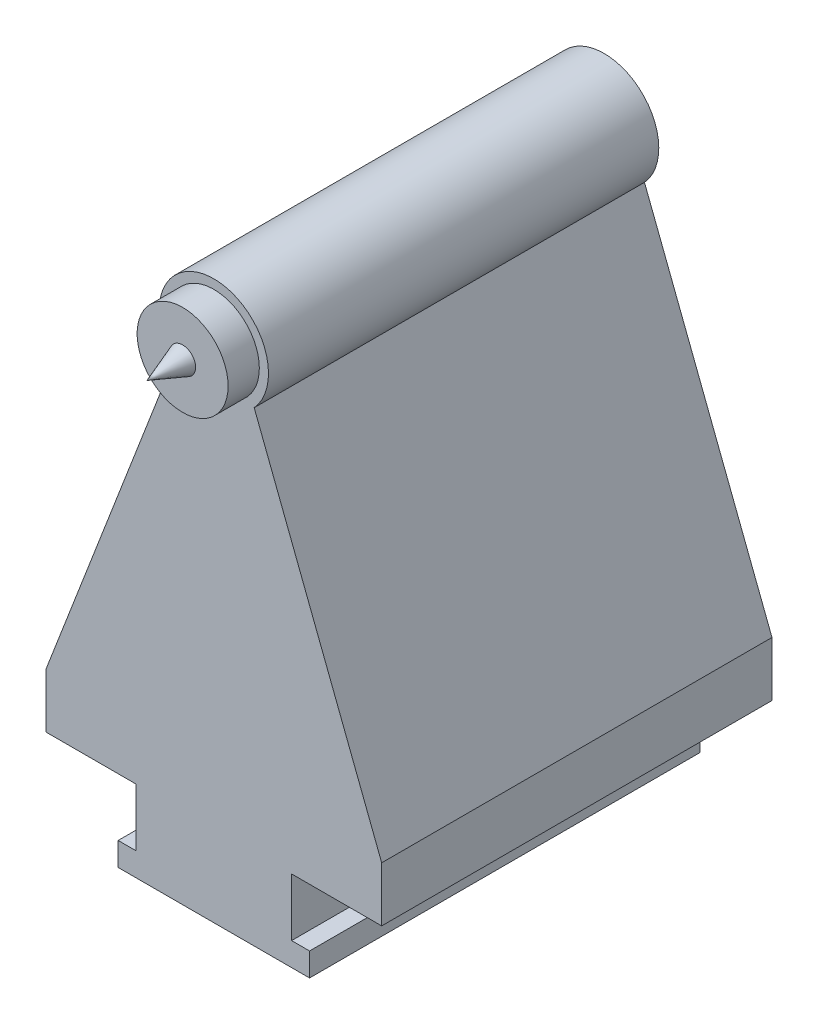
ISO-10303-21;
HEADER;
FILE_DESCRIPTION(('STEP AP214'),'2;1');
FILE_NAME('part.step','',(''),(''),'','','');
FILE_SCHEMA(('AUTOMOTIVE_DESIGN { 1 0 10303 214 1 1 1 1 }'));
ENDSEC;
DATA;
#1=APPLICATION_CONTEXT('core data for automotive mechanical design processes');
#2=APPLICATION_PROTOCOL_DEFINITION('international standard','automotive_design',2000,#1);
#3=PRODUCT_CONTEXT('',#1,'mechanical');
#4=PRODUCT('Part','Part','',(#3));
#5=PRODUCT_RELATED_PRODUCT_CATEGORY('part','',(#4));
#6=PRODUCT_DEFINITION_FORMATION('','',#4);
#7=PRODUCT_DEFINITION_CONTEXT('part definition',#1,'design');
#8=PRODUCT_DEFINITION('design','',#6,#7);
#9=PRODUCT_DEFINITION_SHAPE('','',#8);
#10=(LENGTH_UNIT() NAMED_UNIT(*) SI_UNIT(.MILLI.,.METRE.));
#11=(NAMED_UNIT(*) PLANE_ANGLE_UNIT() SI_UNIT($,.RADIAN.));
#12=(NAMED_UNIT(*) SI_UNIT($,.STERADIAN.) SOLID_ANGLE_UNIT());
#13=UNCERTAINTY_MEASURE_WITH_UNIT(LENGTH_MEASURE(1.E-05),#10,'distance_accuracy_value','');
#14=(GEOMETRIC_REPRESENTATION_CONTEXT(3) GLOBAL_UNCERTAINTY_ASSIGNED_CONTEXT((#13)) GLOBAL_UNIT_ASSIGNED_CONTEXT((#10,
#11,#12)) REPRESENTATION_CONTEXT('',''));
#15=CARTESIAN_POINT('',(0.,0.,0.));
#16=DIRECTION('',(0.,0.,1.));
#17=DIRECTION('',(1.,0.,0.));
#18=AXIS2_PLACEMENT_3D('',#15,#16,#17);
#19=CARTESIAN_POINT('',(258.134543793799,99.6200797159665,250.));
#20=DIRECTION('',(-0.932936237589077,-0.360041631749909,0.));
#21=DIRECTION('',(0.360041631749909,-0.932936237589077,0.));
#22=AXIS2_PLACEMENT_3D('',#19,#20,#21);
#23=PLANE('',#22);
#24=DIRECTION('',(-0.360041631749909,0.932936237589077,0.));
#25=VECTOR('',#24,1.);
#26=CARTESIAN_POINT('',(258.134543793799,99.6200797159665,0.));
#27=LINE('',#26,#25);
#28=CARTESIAN_POINT('',(227.500000000004,179.000000000001,0.));
#29=VERTEX_POINT('',#28);
#30=CARTESIAN_POINT('',(145.832850365107,390.615092801068,0.));
#31=VERTEX_POINT('',#30);
#32=EDGE_CURVE('E166',#29,#31,#27,.T.);
#33=ORIENTED_EDGE('',*,*,#32,.T.);
#34=DIRECTION('',(0.,0.,-1.));
#35=VECTOR('',#34,1.);
#36=CARTESIAN_POINT('',(145.832850365107,390.615092801068,250.));
#37=LINE('',#36,#35);
#38=CARTESIAN_POINT('',(145.832850365107,390.615092801068,250.));
#39=VERTEX_POINT('',#38);
#40=EDGE_CURVE('E11',#39,#31,#37,.T.);
#41=ORIENTED_EDGE('',*,*,#40,.F.);
#42=DIRECTION('',(-0.360041631749909,0.932936237589077,0.));
#43=VECTOR('',#42,1.);
#44=CARTESIAN_POINT('',(258.134543793799,99.6200797159665,250.));
#45=LINE('',#44,#43);
#46=CARTESIAN_POINT('',(227.500000000004,179.000000000001,250.));
#47=VERTEX_POINT('',#46);
#48=EDGE_CURVE('E195',#47,#39,#45,.T.);
#49=ORIENTED_EDGE('',*,*,#48,.F.);
#50=DIRECTION('',(0.,0.,-1.));
#51=VECTOR('',#50,1.);
#52=CARTESIAN_POINT('',(227.500000000004,179.000000000001,250.));
#53=LINE('',#52,#51);
#54=EDGE_CURVE('E162',#47,#29,#53,.T.);
#55=ORIENTED_EDGE('',*,*,#54,.T.);
#56=EDGE_LOOP('',(#33,#41,#49,#55));
#57=FACE_BOUND('',#56,.T.);
#58=ADVANCED_FACE('F32',(#57),#23,.F.);
#59=CARTESIAN_POINT('',(120.000000000003,414.230000000002,250.));
#60=DIRECTION('',(0.,0.,-1.));
#61=DIRECTION('',(-1.,0.,0.));
#62=AXIS2_PLACEMENT_3D('',#59,#60,#61);
#63=CYLINDRICAL_SURFACE('',#62,35.);
#64=CARTESIAN_POINT('',(120.000000000003,414.230000000002,0.));
#65=DIRECTION('',(0.,0.,1.));
#66=DIRECTION('',(1.,0.,0.));
#67=AXIS2_PLACEMENT_3D('',#64,#65,#66);
#68=CIRCLE('',#67,35.);
#69=CARTESIAN_POINT('',(94.1671496349019,390.615092801067,0.));
#70=VERTEX_POINT('',#69);
#71=EDGE_CURVE('E169',#31,#70,#68,.T.);
#72=ORIENTED_EDGE('',*,*,#71,.T.);
#73=DIRECTION('',(0.,0.,-1.));
#74=VECTOR('',#73,1.);
#75=CARTESIAN_POINT('',(94.1671496349019,390.615092801067,250.));
#76=LINE('',#75,#74);
#77=CARTESIAN_POINT('',(94.1671496349019,390.615092801067,250.));
#78=VERTEX_POINT('',#77);
#79=EDGE_CURVE('E40',#78,#70,#76,.T.);
#80=ORIENTED_EDGE('',*,*,#79,.F.);
#81=CARTESIAN_POINT('',(120.000000000003,414.230000000002,250.));
#82=DIRECTION('',(0.,0.,1.));
#83=DIRECTION('',(1.,0.,0.));
#84=AXIS2_PLACEMENT_3D('',#81,#82,#83);
#85=CIRCLE('',#84,35.);
#86=EDGE_CURVE('E110',#39,#78,#85,.T.);
#87=ORIENTED_EDGE('',*,*,#86,.F.);
#88=ORIENTED_EDGE('',*,*,#40,.T.);
#89=EDGE_LOOP('',(#72,#80,#87,#88));
#90=FACE_BOUND('',#89,.T.);
#91=ADVANCED_FACE('F279',(#90),#63,.T.);
#92=CARTESIAN_POINT('',(-49.2457381761471,19.0050672439191,250.));
#93=DIRECTION('',(0.932936237589074,-0.360041631749917,0.));
#94=DIRECTION('',(0.360041631749917,0.932936237589074,0.));
#95=AXIS2_PLACEMENT_3D('',#92,#93,#94);
#96=PLANE('',#95);
#97=DIRECTION('',(-0.360041631749917,-0.932936237589074,0.));
#98=VECTOR('',#97,1.);
#99=CARTESIAN_POINT('',(-49.2457381761471,19.0050672439191,0.));
#100=LINE('',#99,#98);
#101=CARTESIAN_POINT('',(12.5000000000037,179.000000000001,0.));
#102=VERTEX_POINT('',#101);
#103=EDGE_CURVE('E172',#70,#102,#100,.T.);
#104=ORIENTED_EDGE('',*,*,#103,.T.);
#105=DIRECTION('',(0.,0.,-1.));
#106=VECTOR('',#105,1.);
#107=CARTESIAN_POINT('',(12.5000000000037,179.000000000001,250.));
#108=LINE('',#107,#106);
#109=CARTESIAN_POINT('',(12.5000000000037,179.000000000001,250.));
#110=VERTEX_POINT('',#109);
#111=EDGE_CURVE('E219',#110,#102,#108,.T.);
#112=ORIENTED_EDGE('',*,*,#111,.F.);
#113=DIRECTION('',(-0.360041631749917,-0.932936237589074,0.));
#114=VECTOR('',#113,1.);
#115=CARTESIAN_POINT('',(-49.2457381761471,19.0050672439191,250.));
#116=LINE('',#115,#114);
#117=EDGE_CURVE('E226',#78,#110,#116,.T.);
#118=ORIENTED_EDGE('',*,*,#117,.F.);
#119=ORIENTED_EDGE('',*,*,#79,.T.);
#120=EDGE_LOOP('',(#104,#112,#118,#119));
#121=FACE_BOUND('',#120,.T.);
#122=ADVANCED_FACE('F224',(#121),#96,.F.);
#123=CARTESIAN_POINT('',(12.5000000000035,0.,250.));
#124=DIRECTION('',(-1.,0.,0.));
#125=DIRECTION('',(0.,-1.,0.));
#126=AXIS2_PLACEMENT_3D('',#123,#124,#125);
#127=PLANE('',#126);
#128=DIRECTION('',(0.,1.,0.));
#129=VECTOR('',#128,1.);
#130=CARTESIAN_POINT('',(12.5000000000035,0.,0.));
#131=LINE('',#130,#129);
#132=CARTESIAN_POINT('',(12.5000000000037,144.000000000001,0.));
#133=VERTEX_POINT('',#132);
#134=EDGE_CURVE('E175',#133,#102,#131,.T.);
#135=ORIENTED_EDGE('',*,*,#134,.F.);
#136=DIRECTION('',(0.,0.,-1.));
#137=VECTOR('',#136,1.);
#138=CARTESIAN_POINT('',(12.5000000000037,144.000000000001,250.));
#139=LINE('',#138,#137);
#140=CARTESIAN_POINT('',(12.5000000000037,144.000000000001,250.));
#141=VERTEX_POINT('',#140);
#142=EDGE_CURVE('E217',#141,#133,#139,.T.);
#143=ORIENTED_EDGE('',*,*,#142,.F.);
#144=DIRECTION('',(0.,1.,0.));
#145=VECTOR('',#144,1.);
#146=CARTESIAN_POINT('',(12.5000000000035,0.,250.));
#147=LINE('',#146,#145);
#148=EDGE_CURVE('E238',#141,#110,#147,.T.);
#149=ORIENTED_EDGE('',*,*,#148,.T.);
#150=ORIENTED_EDGE('',*,*,#111,.T.);
#151=EDGE_LOOP('',(#135,#143,#149,#150));
#152=FACE_BOUND('',#151,.T.);
#153=ADVANCED_FACE('F234',(#152),#127,.T.);
#154=CARTESIAN_POINT('',(0.,144.000000000001,250.));
#155=DIRECTION('',(0.,1.,0.));
#156=DIRECTION('',(0.,0.,1.));
#157=AXIS2_PLACEMENT_3D('',#154,#155,#156);
#158=PLANE('',#157);
#159=DIRECTION('',(1.,0.,0.));
#160=VECTOR('',#159,1.);
#161=CARTESIAN_POINT('',(0.,144.000000000001,0.));
#162=LINE('',#161,#160);
#163=CARTESIAN_POINT('',(70.2000000000066,144.000000000001,0.));
#164=VERTEX_POINT('',#163);
#165=EDGE_CURVE('E178',#133,#164,#162,.T.);
#166=ORIENTED_EDGE('',*,*,#165,.T.);
#167=DIRECTION('',(0.,0.,-1.));
#168=VECTOR('',#167,1.);
#169=CARTESIAN_POINT('',(70.2000000000066,144.000000000001,250.));
#170=LINE('',#169,#168);
#171=CARTESIAN_POINT('',(70.2000000000066,144.000000000001,250.));
#172=VERTEX_POINT('',#171);
#173=EDGE_CURVE('E214',#172,#164,#170,.T.);
#174=ORIENTED_EDGE('',*,*,#173,.F.);
#175=DIRECTION('',(1.,0.,0.));
#176=VECTOR('',#175,1.);
#177=CARTESIAN_POINT('',(0.,144.000000000001,250.));
#178=LINE('',#177,#176);
#179=EDGE_CURVE('E239',#141,#172,#178,.T.);
#180=ORIENTED_EDGE('',*,*,#179,.F.);
#181=ORIENTED_EDGE('',*,*,#142,.T.);
#182=EDGE_LOOP('',(#166,#174,#180,#181));
#183=FACE_BOUND('',#182,.T.);
#184=ADVANCED_FACE('F290',(#183),#158,.F.);
#185=CARTESIAN_POINT('',(70.2000000000067,0.,250.));
#186=DIRECTION('',(1.,0.,0.));
#187=DIRECTION('',(0.,1.,0.));
#188=AXIS2_PLACEMENT_3D('',#185,#186,#187);
#189=PLANE('',#188);
#190=DIRECTION('',(0.,-1.,0.));
#191=VECTOR('',#190,1.);
#192=CARTESIAN_POINT('',(70.2000000000067,0.,0.));
#193=LINE('',#192,#191);
#194=CARTESIAN_POINT('',(70.2000000000066,107.000000000001,0.));
#195=VERTEX_POINT('',#194);
#196=EDGE_CURVE('E180',#164,#195,#193,.T.);
#197=ORIENTED_EDGE('',*,*,#196,.T.);
#198=DIRECTION('',(0.,0.,-1.));
#199=VECTOR('',#198,1.);
#200=CARTESIAN_POINT('',(70.2000000000066,107.000000000001,250.));
#201=LINE('',#200,#199);
#202=CARTESIAN_POINT('',(70.2000000000066,107.000000000001,250.));
#203=VERTEX_POINT('',#202);
#204=EDGE_CURVE('E211',#203,#195,#201,.T.);
#205=ORIENTED_EDGE('',*,*,#204,.F.);
#206=DIRECTION('',(0.,-1.,0.));
#207=VECTOR('',#206,1.);
#208=CARTESIAN_POINT('',(70.2000000000067,0.,250.));
#209=LINE('',#208,#207);
#210=EDGE_CURVE('E241',#172,#203,#209,.T.);
#211=ORIENTED_EDGE('',*,*,#210,.F.);
#212=ORIENTED_EDGE('',*,*,#173,.T.);
#213=EDGE_LOOP('',(#197,#205,#211,#212));
#214=FACE_BOUND('',#213,.T.);
#215=ADVANCED_FACE('F293',(#214),#189,.F.);
#216=CARTESIAN_POINT('',(0.,107.000000000001,250.));
#217=DIRECTION('',(0.,-1.,0.));
#218=DIRECTION('',(0.,0.,-1.));
#219=AXIS2_PLACEMENT_3D('',#216,#217,#218);
#220=PLANE('',#219);
#221=DIRECTION('',(-1.,0.,0.));
#222=VECTOR('',#221,1.);
#223=CARTESIAN_POINT('',(0.,107.000000000001,0.));
#224=LINE('',#223,#222);
#225=CARTESIAN_POINT('',(58.7000000000066,107.000000000001,0.));
#226=VERTEX_POINT('',#225);
#227=EDGE_CURVE('E182',#195,#226,#224,.T.);
#228=ORIENTED_EDGE('',*,*,#227,.T.);
#229=DIRECTION('',(0.,0.,-1.));
#230=VECTOR('',#229,1.);
#231=CARTESIAN_POINT('',(58.7000000000066,107.000000000001,250.));
#232=LINE('',#231,#230);
#233=CARTESIAN_POINT('',(58.7000000000066,107.000000000001,250.));
#234=VERTEX_POINT('',#233);
#235=EDGE_CURVE('E208',#234,#226,#232,.T.);
#236=ORIENTED_EDGE('',*,*,#235,.F.);
#237=DIRECTION('',(-1.,0.,0.));
#238=VECTOR('',#237,1.);
#239=CARTESIAN_POINT('',(0.,107.000000000001,250.));
#240=LINE('',#239,#238);
#241=EDGE_CURVE('E247',#203,#234,#240,.T.);
#242=ORIENTED_EDGE('',*,*,#241,.F.);
#243=ORIENTED_EDGE('',*,*,#204,.T.);
#244=EDGE_LOOP('',(#228,#236,#242,#243));
#245=FACE_BOUND('',#244,.T.);
#246=ADVANCED_FACE('F297',(#245),#220,.F.);
#247=CARTESIAN_POINT('',(58.7000000000067,0.,250.));
#248=DIRECTION('',(1.,0.,0.));
#249=DIRECTION('',(0.,1.,0.));
#250=AXIS2_PLACEMENT_3D('',#247,#248,#249);
#251=PLANE('',#250);
#252=DIRECTION('',(0.,-1.,0.));
#253=VECTOR('',#252,1.);
#254=CARTESIAN_POINT('',(58.7000000000067,0.,0.));
#255=LINE('',#254,#253);
#256=CARTESIAN_POINT('',(58.7000000000066,91.9999999999995,0.));
#257=VERTEX_POINT('',#256);
#258=EDGE_CURVE('E184',#226,#257,#255,.T.);
#259=ORIENTED_EDGE('',*,*,#258,.T.);
#260=DIRECTION('',(0.,0.,-1.));
#261=VECTOR('',#260,1.);
#262=CARTESIAN_POINT('',(58.7000000000066,91.9999999999995,250.));
#263=LINE('',#262,#261);
#264=CARTESIAN_POINT('',(58.7000000000066,91.9999999999995,250.));
#265=VERTEX_POINT('',#264);
#266=EDGE_CURVE('E205',#265,#257,#263,.T.);
#267=ORIENTED_EDGE('',*,*,#266,.F.);
#268=DIRECTION('',(0.,-1.,0.));
#269=VECTOR('',#268,1.);
#270=CARTESIAN_POINT('',(58.7000000000067,0.,250.));
#271=LINE('',#270,#269);
#272=EDGE_CURVE('E249',#234,#265,#271,.T.);
#273=ORIENTED_EDGE('',*,*,#272,.F.);
#274=ORIENTED_EDGE('',*,*,#235,.T.);
#275=EDGE_LOOP('',(#259,#267,#273,#274));
#276=FACE_BOUND('',#275,.T.);
#277=ADVANCED_FACE('F301',(#276),#251,.F.);
#278=CARTESIAN_POINT('',(0.,91.9999999999995,250.));
#279=DIRECTION('',(0.,1.,0.));
#280=DIRECTION('',(-1.,0.,0.));
#281=AXIS2_PLACEMENT_3D('',#278,#279,#280);
#282=PLANE('',#281);
#283=DIRECTION('',(1.,0.,0.));
#284=VECTOR('',#283,1.);
#285=CARTESIAN_POINT('',(0.,91.9999999999995,0.));
#286=LINE('',#285,#284);
#287=CARTESIAN_POINT('',(181.3,91.9999999999995,0.));
#288=VERTEX_POINT('',#287);
#289=EDGE_CURVE('E186',#257,#288,#286,.T.);
#290=ORIENTED_EDGE('',*,*,#289,.T.);
#291=DIRECTION('',(0.,0.,-1.));
#292=VECTOR('',#291,1.);
#293=CARTESIAN_POINT('',(181.3,91.9999999999995,250.));
#294=LINE('',#293,#292);
#295=CARTESIAN_POINT('',(181.3,91.9999999999995,250.));
#296=VERTEX_POINT('',#295);
#297=EDGE_CURVE('E202',#296,#288,#294,.T.);
#298=ORIENTED_EDGE('',*,*,#297,.F.);
#299=DIRECTION('',(1.,0.,0.));
#300=VECTOR('',#299,1.);
#301=CARTESIAN_POINT('',(0.,91.9999999999995,250.));
#302=LINE('',#301,#300);
#303=EDGE_CURVE('E251',#265,#296,#302,.T.);
#304=ORIENTED_EDGE('',*,*,#303,.F.);
#305=ORIENTED_EDGE('',*,*,#266,.T.);
#306=EDGE_LOOP('',(#290,#298,#304,#305));
#307=FACE_BOUND('',#306,.T.);
#308=ADVANCED_FACE('F305',(#307),#282,.F.);
#309=CARTESIAN_POINT('',(181.3,-6.70944781215114E-13,250.));
#310=DIRECTION('',(-1.,0.,0.));
#311=DIRECTION('',(0.,-1.,0.));
#312=AXIS2_PLACEMENT_3D('',#309,#310,#311);
#313=PLANE('',#312);
#314=DIRECTION('',(0.,1.,0.));
#315=VECTOR('',#314,1.);
#316=CARTESIAN_POINT('',(181.3,-6.70944781215114E-13,0.));
#317=LINE('',#316,#315);
#318=CARTESIAN_POINT('',(181.3,107.,0.));
#319=VERTEX_POINT('',#318);
#320=EDGE_CURVE('E188',#288,#319,#317,.T.);
#321=ORIENTED_EDGE('',*,*,#320,.T.);
#322=DIRECTION('',(0.,0.,-1.));
#323=VECTOR('',#322,1.);
#324=CARTESIAN_POINT('',(181.3,107.,250.));
#325=LINE('',#324,#323);
#326=CARTESIAN_POINT('',(181.3,107.,250.));
#327=VERTEX_POINT('',#326);
#328=EDGE_CURVE('E199',#327,#319,#325,.T.);
#329=ORIENTED_EDGE('',*,*,#328,.F.);
#330=DIRECTION('',(0.,1.,0.));
#331=VECTOR('',#330,1.);
#332=CARTESIAN_POINT('',(181.3,-6.70944781215114E-13,250.));
#333=LINE('',#332,#331);
#334=EDGE_CURVE('E253',#296,#327,#333,.T.);
#335=ORIENTED_EDGE('',*,*,#334,.F.);
#336=ORIENTED_EDGE('',*,*,#297,.T.);
#337=EDGE_LOOP('',(#321,#329,#335,#336));
#338=FACE_BOUND('',#337,.T.);
#339=ADVANCED_FACE('F259',(#338),#313,.F.);
#340=CARTESIAN_POINT('',(7.10180706513065E-12,107.000000000012,250.));
#341=DIRECTION('',(0.,-1.,0.));
#342=DIRECTION('',(1.,0.,0.));
#343=AXIS2_PLACEMENT_3D('',#340,#341,#342);
#344=PLANE('',#343);
#345=DIRECTION('',(-1.,0.,0.));
#346=VECTOR('',#345,1.);
#347=CARTESIAN_POINT('',(7.10180706513065E-12,107.000000000012,0.));
#348=LINE('',#347,#346);
#349=CARTESIAN_POINT('',(169.800000000001,107.000000000001,0.));
#350=VERTEX_POINT('',#349);
#351=EDGE_CURVE('E190',#319,#350,#348,.T.);
#352=ORIENTED_EDGE('',*,*,#351,.T.);
#353=DIRECTION('',(0.,0.,-1.));
#354=VECTOR('',#353,1.);
#355=CARTESIAN_POINT('',(169.800000000001,107.000000000001,250.));
#356=LINE('',#355,#354);
#357=CARTESIAN_POINT('',(169.800000000001,107.000000000001,250.));
#358=VERTEX_POINT('',#357);
#359=EDGE_CURVE('E157',#358,#350,#356,.T.);
#360=ORIENTED_EDGE('',*,*,#359,.F.);
#361=DIRECTION('',(-1.,0.,0.));
#362=VECTOR('',#361,1.);
#363=CARTESIAN_POINT('',(7.10180706513065E-12,107.000000000012,250.));
#364=LINE('',#363,#362);
#365=EDGE_CURVE('E148',#327,#358,#364,.T.);
#366=ORIENTED_EDGE('',*,*,#365,.F.);
#367=ORIENTED_EDGE('',*,*,#328,.T.);
#368=EDGE_LOOP('',(#352,#360,#366,#367));
#369=FACE_BOUND('',#368,.T.);
#370=ADVANCED_FACE('F263',(#369),#344,.F.);
#371=CARTESIAN_POINT('',(169.800000000001,-1.27375587554968E-13,250.));
#372=DIRECTION('',(-1.,0.,0.));
#373=DIRECTION('',(0.,-1.,0.));
#374=AXIS2_PLACEMENT_3D('',#371,#372,#373);
#375=PLANE('',#374);
#376=DIRECTION('',(0.,1.,0.));
#377=VECTOR('',#376,1.);
#378=CARTESIAN_POINT('',(169.800000000001,-1.27375587554968E-13,0.));
#379=LINE('',#378,#377);
#380=CARTESIAN_POINT('',(169.800000000001,144.000000000001,0.));
#381=VERTEX_POINT('',#380);
#382=EDGE_CURVE('E156',#350,#381,#379,.T.);
#383=ORIENTED_EDGE('',*,*,#382,.T.);
#384=DIRECTION('',(0.,0.,-1.));
#385=VECTOR('',#384,1.);
#386=CARTESIAN_POINT('',(169.800000000001,144.000000000001,250.));
#387=LINE('',#386,#385);
#388=CARTESIAN_POINT('',(169.800000000001,144.000000000001,250.));
#389=VERTEX_POINT('',#388);
#390=EDGE_CURVE('E153',#389,#381,#387,.T.);
#391=ORIENTED_EDGE('',*,*,#390,.F.);
#392=DIRECTION('',(0.,1.,0.));
#393=VECTOR('',#392,1.);
#394=CARTESIAN_POINT('',(169.800000000001,-1.27375587554968E-13,250.));
#395=LINE('',#394,#393);
#396=EDGE_CURVE('E142',#358,#389,#395,.T.);
#397=ORIENTED_EDGE('',*,*,#396,.F.);
#398=ORIENTED_EDGE('',*,*,#359,.T.);
#399=EDGE_LOOP('',(#383,#391,#397,#398));
#400=FACE_BOUND('',#399,.T.);
#401=ADVANCED_FACE('F154',(#400),#375,.F.);
#402=CARTESIAN_POINT('',(0.,144.000000000001,250.));
#403=DIRECTION('',(0.,1.,0.));
#404=DIRECTION('',(0.,0.,1.));
#405=AXIS2_PLACEMENT_3D('',#402,#403,#404);
#406=PLANE('',#405);
#407=DIRECTION('',(1.,0.,0.));
#408=VECTOR('',#407,1.);
#409=CARTESIAN_POINT('',(0.,144.000000000001,0.));
#410=LINE('',#409,#408);
#411=CARTESIAN_POINT('',(227.500000000004,144.000000000001,0.));
#412=VERTEX_POINT('',#411);
#413=EDGE_CURVE('E96',#381,#412,#410,.T.);
#414=ORIENTED_EDGE('',*,*,#413,.T.);
#415=DIRECTION('',(0.,0.,-1.));
#416=VECTOR('',#415,1.);
#417=CARTESIAN_POINT('',(227.500000000004,144.000000000001,250.));
#418=LINE('',#417,#416);
#419=CARTESIAN_POINT('',(227.500000000004,144.000000000001,250.));
#420=VERTEX_POINT('',#419);
#421=EDGE_CURVE('E158',#420,#412,#418,.T.);
#422=ORIENTED_EDGE('',*,*,#421,.F.);
#423=DIRECTION('',(1.,0.,0.));
#424=VECTOR('',#423,1.);
#425=CARTESIAN_POINT('',(0.,144.000000000001,250.));
#426=LINE('',#425,#424);
#427=EDGE_CURVE('E146',#389,#420,#426,.T.);
#428=ORIENTED_EDGE('',*,*,#427,.F.);
#429=ORIENTED_EDGE('',*,*,#390,.T.);
#430=EDGE_LOOP('',(#414,#422,#428,#429));
#431=FACE_BOUND('',#430,.T.);
#432=ADVANCED_FACE('F160',(#431),#406,.F.);
#433=CARTESIAN_POINT('',(227.500000000004,0.,250.));
#434=DIRECTION('',(-1.,0.,0.));
#435=DIRECTION('',(0.,0.,1.));
#436=AXIS2_PLACEMENT_3D('',#433,#434,#435);
#437=PLANE('',#436);
#438=DIRECTION('',(0.,1.,0.));
#439=VECTOR('',#438,1.);
#440=CARTESIAN_POINT('',(227.500000000004,0.,0.));
#441=LINE('',#440,#439);
#442=EDGE_CURVE('E102',#412,#29,#441,.T.);
#443=ORIENTED_EDGE('',*,*,#442,.T.);
#444=ORIENTED_EDGE('',*,*,#54,.F.);
#445=DIRECTION('',(0.,1.,0.));
#446=VECTOR('',#445,1.);
#447=CARTESIAN_POINT('',(227.500000000004,0.,250.));
#448=LINE('',#447,#446);
#449=EDGE_CURVE('E48',#420,#47,#448,.T.);
#450=ORIENTED_EDGE('',*,*,#449,.F.);
#451=ORIENTED_EDGE('',*,*,#421,.T.);
#452=EDGE_LOOP('',(#443,#444,#450,#451));
#453=FACE_BOUND('',#452,.T.);
#454=ADVANCED_FACE('F267',(#453),#437,.F.);
#455=CARTESIAN_POINT('',(0.,0.,250.));
#456=DIRECTION('',(0.,0.,1.));
#457=DIRECTION('',(1.,0.,0.));
#458=AXIS2_PLACEMENT_3D('',#455,#456,#457);
#459=PLANE('',#458);
#460=CARTESIAN_POINT('',(120.000000000003,414.230000000002,250.));
#461=DIRECTION('',(0.,0.,1.));
#462=DIRECTION('',(1.,0.,0.));
#463=AXIS2_PLACEMENT_3D('',#460,#461,#462);
#464=CIRCLE('',#463,29.1295767322247);
#465=CARTESIAN_POINT('',(149.129576732228,414.230000000002,250.));
#466=VERTEX_POINT('',#465);
#467=EDGE_CURVE('E381',#466,#466,#464,.T.);
#468=ORIENTED_EDGE('',*,*,#467,.F.);
#469=EDGE_LOOP('',(#468));
#470=FACE_BOUND('',#469,.T.);
#471=ORIENTED_EDGE('',*,*,#48,.T.);
#472=ORIENTED_EDGE('',*,*,#86,.T.);
#473=ORIENTED_EDGE('',*,*,#117,.T.);
#474=ORIENTED_EDGE('',*,*,#148,.F.);
#475=ORIENTED_EDGE('',*,*,#179,.T.);
#476=ORIENTED_EDGE('',*,*,#210,.T.);
#477=ORIENTED_EDGE('',*,*,#241,.T.);
#478=ORIENTED_EDGE('',*,*,#272,.T.);
#479=ORIENTED_EDGE('',*,*,#303,.T.);
#480=ORIENTED_EDGE('',*,*,#334,.T.);
#481=ORIENTED_EDGE('',*,*,#365,.T.);
#482=ORIENTED_EDGE('',*,*,#396,.T.);
#483=ORIENTED_EDGE('',*,*,#427,.T.);
#484=ORIENTED_EDGE('',*,*,#449,.T.);
#485=EDGE_LOOP('',(#471,#472,#473,#474,#475,#476,#477,#478,#479,#480,#481,#482,#483,#484));
#486=FACE_BOUND('',#485,.T.);
#487=ADVANCED_FACE('F144',(#470,#486),#459,.T.);
#488=CARTESIAN_POINT('',(0.,0.,0.));
#489=DIRECTION('',(0.,0.,1.));
#490=DIRECTION('',(1.,0.,0.));
#491=AXIS2_PLACEMENT_3D('',#488,#489,#490);
#492=PLANE('',#491);
#493=ORIENTED_EDGE('',*,*,#32,.F.);
#494=ORIENTED_EDGE('',*,*,#442,.F.);
#495=ORIENTED_EDGE('',*,*,#413,.F.);
#496=ORIENTED_EDGE('',*,*,#382,.F.);
#497=ORIENTED_EDGE('',*,*,#351,.F.);
#498=ORIENTED_EDGE('',*,*,#320,.F.);
#499=ORIENTED_EDGE('',*,*,#289,.F.);
#500=ORIENTED_EDGE('',*,*,#258,.F.);
#501=ORIENTED_EDGE('',*,*,#227,.F.);
#502=ORIENTED_EDGE('',*,*,#196,.F.);
#503=ORIENTED_EDGE('',*,*,#165,.F.);
#504=ORIENTED_EDGE('',*,*,#134,.T.);
#505=ORIENTED_EDGE('',*,*,#103,.F.);
#506=ORIENTED_EDGE('',*,*,#71,.F.);
#507=EDGE_LOOP('',(#493,#494,#495,#496,#497,#498,#499,#500,#501,#502,#503,#504,#505,#506));
#508=FACE_BOUND('',#507,.T.);
#509=ADVANCED_FACE('F229',(#508),#492,.F.);
#510=CARTESIAN_POINT('',(120.000000000003,414.230000000002,270.));
#511=DIRECTION('',(0.,0.,-1.));
#512=DIRECTION('',(-1.,0.,0.));
#513=AXIS2_PLACEMENT_3D('',#510,#511,#512);
#514=CYLINDRICAL_SURFACE('',#513,29.1295767322247);
#515=CARTESIAN_POINT('',(120.000000000003,414.230000000002,270.));
#516=DIRECTION('',(0.,0.,1.));
#517=DIRECTION('',(1.,0.,0.));
#518=AXIS2_PLACEMENT_3D('',#515,#516,#517);
#519=CIRCLE('',#518,29.1295767322247);
#520=CARTESIAN_POINT('',(149.129576732228,414.230000000002,270.));
#521=VERTEX_POINT('',#520);
#522=EDGE_CURVE('E170',#521,#521,#519,.T.);
#523=ORIENTED_EDGE('',*,*,#522,.F.);
#524=EDGE_LOOP('',(#523));
#525=FACE_BOUND('',#524,.T.);
#526=ORIENTED_EDGE('',*,*,#467,.T.);
#527=EDGE_LOOP('',(#526));
#528=FACE_BOUND('',#527,.T.);
#529=ADVANCED_FACE('F337',(#525,#528),#514,.T.);
#530=CARTESIAN_POINT('',(120.000000000003,414.230000000002,270.));
#531=DIRECTION('',(0.,0.,1.));
#532=DIRECTION('',(1.,0.,0.));
#533=AXIS2_PLACEMENT_3D('',#530,#531,#532);
#534=PLANE('',#533);
#535=CARTESIAN_POINT('',(120.000000000003,414.230000000002,270.));
#536=DIRECTION('',(0.,0.,1.));
#537=DIRECTION('',(1.,0.,0.));
#538=AXIS2_PLACEMENT_3D('',#535,#536,#537);
#539=CIRCLE('',#538,8.31600000000003);
#540=CARTESIAN_POINT('',(128.316000000003,414.230000000002,270.));
#541=VERTEX_POINT('',#540);
#542=EDGE_CURVE('E380',#541,#541,#539,.T.);
#543=ORIENTED_EDGE('',*,*,#542,.F.);
#544=EDGE_LOOP('',(#543));
#545=FACE_BOUND('',#544,.T.);
#546=ORIENTED_EDGE('',*,*,#522,.T.);
#547=EDGE_LOOP('',(#546));
#548=FACE_BOUND('',#547,.T.);
#549=ADVANCED_FACE('F352',(#545,#548),#534,.T.);
#550=CARTESIAN_POINT('',(120.000000000003,414.230000000002,270.));
#551=DIRECTION('',(0.,0.,-1.));
#552=DIRECTION('',(1.,0.,0.));
#553=AXIS2_PLACEMENT_3D('',#550,#551,#552);
#554=CONICAL_SURFACE('',#553,8.31600000000003,0.349065850398867);
#555=CARTESIAN_POINT('',(120.000000000003,414.230000000002,292.848022220185));
#556=VERTEX_POINT('',#555);
#557=VERTEX_LOOP('',#556);
#558=FACE_BOUND('',#557,.T.);
#559=ORIENTED_EDGE('',*,*,#542,.T.);
#560=EDGE_LOOP('',(#559));
#561=FACE_BOUND('',#560,.T.);
#562=ADVANCED_FACE('F362',(#558,#561),#554,.T.);
#563=CLOSED_SHELL('',(#58,#91,#122,#153,#184,#215,#246,#277,#308,#339,#370,#401,#432,#454,#487,
#509,#529,#549,#562));
#564=MANIFOLD_SOLID_BREP('B2',#563);
#565=ADVANCED_BREP_SHAPE_REPRESENTATION('',(#18,#564),#14);
#566=SHAPE_DEFINITION_REPRESENTATION(#9,#565);
ENDSEC;
END-ISO-10303-21;
